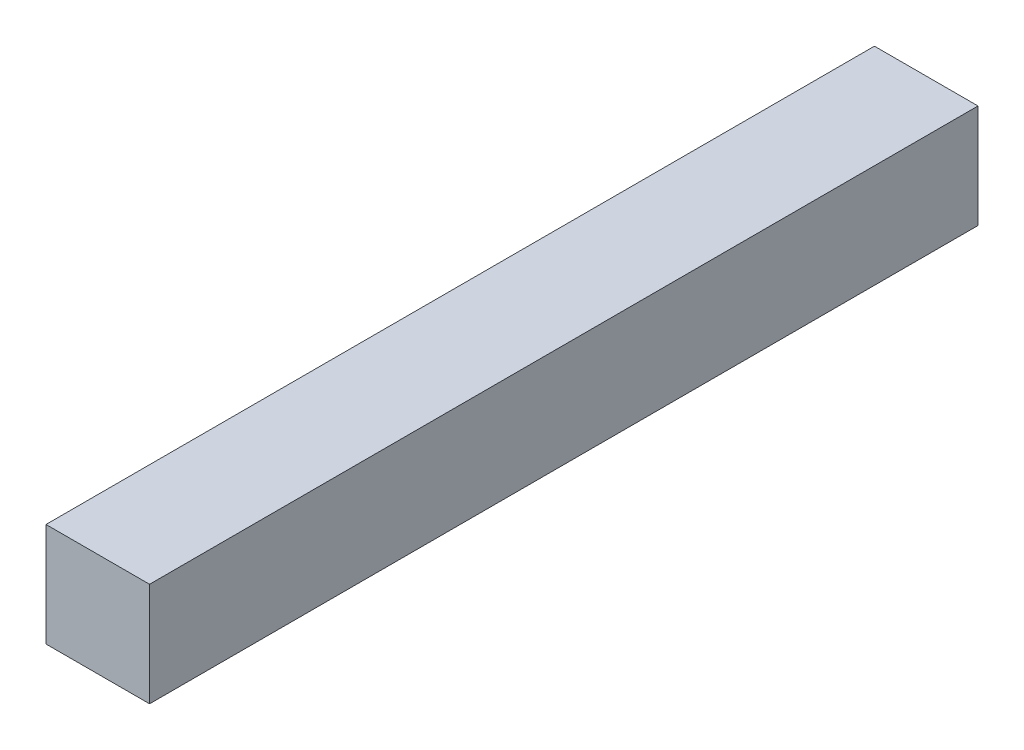
ISO-10303-21;
HEADER;
FILE_DESCRIPTION(('STEP AP214'),'2;1');
FILE_NAME('part.step','',(''),(''),'','','');
FILE_SCHEMA(('AUTOMOTIVE_DESIGN { 1 0 10303 214 1 1 1 1 }'));
ENDSEC;
DATA;
#1=APPLICATION_CONTEXT('core data for automotive mechanical design processes');
#2=APPLICATION_PROTOCOL_DEFINITION('international standard','automotive_design',2000,#1);
#3=PRODUCT_CONTEXT('',#1,'mechanical');
#4=PRODUCT('Part','Part','',(#3));
#5=PRODUCT_RELATED_PRODUCT_CATEGORY('part','',(#4));
#6=PRODUCT_DEFINITION_FORMATION('','',#4);
#7=PRODUCT_DEFINITION_CONTEXT('part definition',#1,'design');
#8=PRODUCT_DEFINITION('design','',#6,#7);
#9=PRODUCT_DEFINITION_SHAPE('','',#8);
#10=(LENGTH_UNIT() NAMED_UNIT(*) SI_UNIT(.MILLI.,.METRE.));
#11=(NAMED_UNIT(*) PLANE_ANGLE_UNIT() SI_UNIT($,.RADIAN.));
#12=(NAMED_UNIT(*) SI_UNIT($,.STERADIAN.) SOLID_ANGLE_UNIT());
#13=UNCERTAINTY_MEASURE_WITH_UNIT(LENGTH_MEASURE(1.E-05),#10,'distance_accuracy_value','');
#14=(GEOMETRIC_REPRESENTATION_CONTEXT(3) GLOBAL_UNCERTAINTY_ASSIGNED_CONTEXT((#13)) GLOBAL_UNIT_ASSIGNED_CONTEXT((#10,
#11,#12)) REPRESENTATION_CONTEXT('',''));
#15=CARTESIAN_POINT('',(0.,0.,0.));
#16=DIRECTION('',(0.,0.,1.));
#17=DIRECTION('',(1.,0.,0.));
#18=AXIS2_PLACEMENT_3D('',#15,#16,#17);
#19=CARTESIAN_POINT('',(-20.4402515723271,22.9559748427673,400.));
#20=DIRECTION('',(1.,0.,0.));
#21=DIRECTION('',(0.,1.,0.));
#22=AXIS2_PLACEMENT_3D('',#19,#20,#21);
#23=PLANE('',#22);
#24=DIRECTION('',(0.,-1.,0.));
#25=VECTOR('',#24,1.);
#26=CARTESIAN_POINT('',(-20.4402515723271,22.9559748427673,0.));
#27=LINE('',#26,#25);
#28=CARTESIAN_POINT('',(-20.4402515723271,22.9559748427673,0.));
#29=VERTEX_POINT('',#28);
#30=CARTESIAN_POINT('',(-20.4402515723271,-27.0440251572327,0.));
#31=VERTEX_POINT('',#30);
#32=EDGE_CURVE('E96',#29,#31,#27,.T.);
#33=ORIENTED_EDGE('',*,*,#32,.T.);
#34=DIRECTION('',(0.,0.,-1.));
#35=VECTOR('',#34,1.);
#36=CARTESIAN_POINT('',(-20.4402515723271,-27.0440251572327,400.));
#37=LINE('',#36,#35);
#38=CARTESIAN_POINT('',(-20.4402515723271,-27.0440251572327,400.));
#39=VERTEX_POINT('',#38);
#40=EDGE_CURVE('E11',#39,#31,#37,.T.);
#41=ORIENTED_EDGE('',*,*,#40,.F.);
#42=DIRECTION('',(0.,-1.,0.));
#43=VECTOR('',#42,1.);
#44=CARTESIAN_POINT('',(-20.4402515723271,22.9559748427673,400.));
#45=LINE('',#44,#43);
#46=CARTESIAN_POINT('',(-20.4402515723271,22.9559748427673,400.));
#47=VERTEX_POINT('',#46);
#48=EDGE_CURVE('E84',#47,#39,#45,.T.);
#49=ORIENTED_EDGE('',*,*,#48,.F.);
#50=DIRECTION('',(0.,0.,-1.));
#51=VECTOR('',#50,1.);
#52=CARTESIAN_POINT('',(-20.4402515723271,22.9559748427673,400.));
#53=LINE('',#52,#51);
#54=EDGE_CURVE('E92',#47,#29,#53,.T.);
#55=ORIENTED_EDGE('',*,*,#54,.T.);
#56=EDGE_LOOP('',(#33,#41,#49,#55));
#57=FACE_BOUND('',#56,.T.);
#58=ADVANCED_FACE('F33',(#57),#23,.F.);
#59=CARTESIAN_POINT('',(-20.4402515723271,-27.0440251572327,400.));
#60=DIRECTION('',(0.,1.,0.));
#61=DIRECTION('',(0.,0.,1.));
#62=AXIS2_PLACEMENT_3D('',#59,#60,#61);
#63=PLANE('',#62);
#64=DIRECTION('',(1.,0.,0.));
#65=VECTOR('',#64,1.);
#66=CARTESIAN_POINT('',(-20.4402515723271,-27.0440251572327,0.));
#67=LINE('',#66,#65);
#68=CARTESIAN_POINT('',(29.5597484276729,-27.0440251572327,0.));
#69=VERTEX_POINT('',#68);
#70=EDGE_CURVE('E88',#31,#69,#67,.T.);
#71=ORIENTED_EDGE('',*,*,#70,.T.);
#72=DIRECTION('',(0.,0.,-1.));
#73=VECTOR('',#72,1.);
#74=CARTESIAN_POINT('',(29.5597484276729,-27.0440251572327,400.));
#75=LINE('',#74,#73);
#76=CARTESIAN_POINT('',(29.5597484276729,-27.0440251572327,400.));
#77=VERTEX_POINT('',#76);
#78=EDGE_CURVE('E41',#77,#69,#75,.T.);
#79=ORIENTED_EDGE('',*,*,#78,.F.);
#80=DIRECTION('',(1.,0.,0.));
#81=VECTOR('',#80,1.);
#82=CARTESIAN_POINT('',(-20.4402515723271,-27.0440251572327,400.));
#83=LINE('',#82,#81);
#84=EDGE_CURVE('E79',#39,#77,#83,.T.);
#85=ORIENTED_EDGE('',*,*,#84,.F.);
#86=ORIENTED_EDGE('',*,*,#40,.T.);
#87=EDGE_LOOP('',(#71,#79,#85,#86));
#88=FACE_BOUND('',#87,.T.);
#89=ADVANCED_FACE('F87',(#88),#63,.F.);
#90=CARTESIAN_POINT('',(29.5597484276729,22.9559748427673,400.));
#91=DIRECTION('',(-1.,0.,0.));
#92=DIRECTION('',(0.,-1.,0.));
#93=AXIS2_PLACEMENT_3D('',#90,#91,#92);
#94=PLANE('',#93);
#95=DIRECTION('',(0.,1.,0.));
#96=VECTOR('',#95,1.);
#97=CARTESIAN_POINT('',(29.5597484276729,22.9559748427673,0.));
#98=LINE('',#97,#96);
#99=CARTESIAN_POINT('',(29.5597484276729,22.9559748427673,0.));
#100=VERTEX_POINT('',#99);
#101=EDGE_CURVE('E66',#69,#100,#98,.T.);
#102=ORIENTED_EDGE('',*,*,#101,.T.);
#103=DIRECTION('',(0.,0.,-1.));
#104=VECTOR('',#103,1.);
#105=CARTESIAN_POINT('',(29.5597484276729,22.9559748427673,400.));
#106=LINE('',#105,#104);
#107=CARTESIAN_POINT('',(29.5597484276729,22.9559748427673,400.));
#108=VERTEX_POINT('',#107);
#109=EDGE_CURVE('E89',#108,#100,#106,.T.);
#110=ORIENTED_EDGE('',*,*,#109,.F.);
#111=DIRECTION('',(0.,1.,0.));
#112=VECTOR('',#111,1.);
#113=CARTESIAN_POINT('',(29.5597484276729,22.9559748427673,400.));
#114=LINE('',#113,#112);
#115=EDGE_CURVE('E82',#77,#108,#114,.T.);
#116=ORIENTED_EDGE('',*,*,#115,.F.);
#117=ORIENTED_EDGE('',*,*,#78,.T.);
#118=EDGE_LOOP('',(#102,#110,#116,#117));
#119=FACE_BOUND('',#118,.T.);
#120=ADVANCED_FACE('F90',(#119),#94,.F.);
#121=CARTESIAN_POINT('',(-20.4402515723271,22.9559748427673,400.));
#122=DIRECTION('',(0.,-1.,0.));
#123=DIRECTION('',(0.,0.,-1.));
#124=AXIS2_PLACEMENT_3D('',#121,#122,#123);
#125=PLANE('',#124);
#126=DIRECTION('',(-1.,0.,0.));
#127=VECTOR('',#126,1.);
#128=CARTESIAN_POINT('',(-20.4402515723271,22.9559748427673,0.));
#129=LINE('',#128,#127);
#130=EDGE_CURVE('E72',#100,#29,#129,.T.);
#131=ORIENTED_EDGE('',*,*,#130,.T.);
#132=ORIENTED_EDGE('',*,*,#54,.F.);
#133=DIRECTION('',(-1.,0.,0.));
#134=VECTOR('',#133,1.);
#135=CARTESIAN_POINT('',(-20.4402515723271,22.9559748427673,400.));
#136=LINE('',#135,#134);
#137=EDGE_CURVE('E49',#108,#47,#136,.T.);
#138=ORIENTED_EDGE('',*,*,#137,.F.);
#139=ORIENTED_EDGE('',*,*,#109,.T.);
#140=EDGE_LOOP('',(#131,#132,#138,#139));
#141=FACE_BOUND('',#140,.T.);
#142=ADVANCED_FACE('F103',(#141),#125,.F.);
#143=CARTESIAN_POINT('',(0.,0.,400.));
#144=DIRECTION('',(0.,0.,1.));
#145=DIRECTION('',(1.,0.,0.));
#146=AXIS2_PLACEMENT_3D('',#143,#144,#145);
#147=PLANE('',#146);
#148=ORIENTED_EDGE('',*,*,#48,.T.);
#149=ORIENTED_EDGE('',*,*,#84,.T.);
#150=ORIENTED_EDGE('',*,*,#115,.T.);
#151=ORIENTED_EDGE('',*,*,#137,.T.);
#152=EDGE_LOOP('',(#148,#149,#150,#151));
#153=FACE_BOUND('',#152,.T.);
#154=ADVANCED_FACE('F80',(#153),#147,.T.);
#155=CARTESIAN_POINT('',(0.,0.,0.));
#156=DIRECTION('',(0.,0.,1.));
#157=DIRECTION('',(1.,0.,0.));
#158=AXIS2_PLACEMENT_3D('',#155,#156,#157);
#159=PLANE('',#158);
#160=ORIENTED_EDGE('',*,*,#32,.F.);
#161=ORIENTED_EDGE('',*,*,#130,.F.);
#162=ORIENTED_EDGE('',*,*,#101,.F.);
#163=ORIENTED_EDGE('',*,*,#70,.F.);
#164=EDGE_LOOP('',(#160,#161,#162,#163));
#165=FACE_BOUND('',#164,.T.);
#166=ADVANCED_FACE('F106',(#165),#159,.F.);
#167=CLOSED_SHELL('',(#58,#89,#120,#142,#154,#166));
#168=MANIFOLD_SOLID_BREP('B2',#167);
#169=ADVANCED_BREP_SHAPE_REPRESENTATION('',(#18,#168),#14);
#170=SHAPE_DEFINITION_REPRESENTATION(#9,#169);
ENDSEC;
END-ISO-10303-21;
